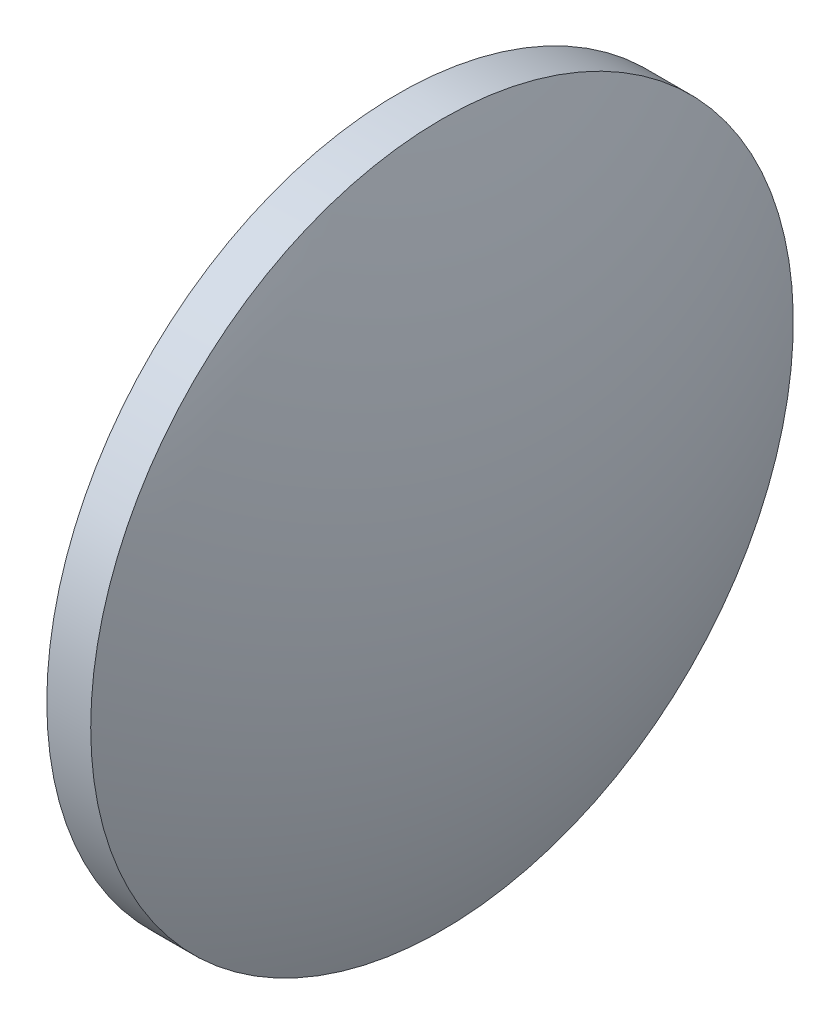
ISO-10303-21;
HEADER;
FILE_DESCRIPTION(('STEP AP214'),'2;1');
FILE_NAME('part.step','',(''),(''),'','','');
FILE_SCHEMA(('AUTOMOTIVE_DESIGN { 1 0 10303 214 1 1 1 1 }'));
ENDSEC;
DATA;
#1=APPLICATION_CONTEXT('core data for automotive mechanical design processes');
#2=APPLICATION_PROTOCOL_DEFINITION('international standard','automotive_design',2000,#1);
#3=PRODUCT_CONTEXT('',#1,'mechanical');
#4=PRODUCT('Part','Part','',(#3));
#5=PRODUCT_RELATED_PRODUCT_CATEGORY('part','',(#4));
#6=PRODUCT_DEFINITION_FORMATION('','',#4);
#7=PRODUCT_DEFINITION_CONTEXT('part definition',#1,'design');
#8=PRODUCT_DEFINITION('design','',#6,#7);
#9=PRODUCT_DEFINITION_SHAPE('','',#8);
#10=(LENGTH_UNIT() NAMED_UNIT(*) SI_UNIT(.MILLI.,.METRE.));
#11=(NAMED_UNIT(*) PLANE_ANGLE_UNIT() SI_UNIT($,.RADIAN.));
#12=(NAMED_UNIT(*) SI_UNIT($,.STERADIAN.) SOLID_ANGLE_UNIT());
#13=UNCERTAINTY_MEASURE_WITH_UNIT(LENGTH_MEASURE(1.E-05),#10,'distance_accuracy_value','');
#14=(GEOMETRIC_REPRESENTATION_CONTEXT(3) GLOBAL_UNCERTAINTY_ASSIGNED_CONTEXT((#13)) GLOBAL_UNIT_ASSIGNED_CONTEXT((#10,
#11,#12)) REPRESENTATION_CONTEXT('',''));
#15=CARTESIAN_POINT('',(0.,0.,0.));
#16=DIRECTION('',(0.,0.,1.));
#17=DIRECTION('',(1.,0.,0.));
#18=AXIS2_PLACEMENT_3D('',#15,#16,#17);
#19=CARTESIAN_POINT('',(495.350514735523,183.981187910867,0.));
#20=DIRECTION('',(-1.,0.,0.));
#21=DIRECTION('',(0.,1.,0.));
#22=AXIS2_PLACEMENT_3D('',#19,#20,#21);
#23=SPHERICAL_SURFACE('',#22,51.6427915632755);
#24=CARTESIAN_POINT('',(542.963306298798,183.981187910867,0.));
#25=DIRECTION('',(-1.,0.,0.));
#26=DIRECTION('',(0.,0.,1.));
#27=AXIS2_PLACEMENT_3D('',#24,#25,#26);
#28=CIRCLE('',#27,20.);
#29=CARTESIAN_POINT('',(542.963306298798,183.981187910867,20.));
#30=VERTEX_POINT('',#29);
#31=EDGE_CURVE('E10',#30,#30,#28,.T.);
#32=ORIENTED_EDGE('',*,*,#31,.F.);
#33=EDGE_LOOP('',(#32));
#34=FACE_BOUND('',#33,.T.);
#35=ADVANCED_FACE('F35',(#34),#23,.T.);
#36=CARTESIAN_POINT('',(530.956808979025,183.981187910867,0.));
#37=DIRECTION('',(-1.,0.,0.));
#38=DIRECTION('',(0.,0.,1.));
#39=AXIS2_PLACEMENT_3D('',#36,#37,#38);
#40=CYLINDRICAL_SURFACE('',#39,20.);
#41=CARTESIAN_POINT('',(540.463306298798,183.981187910867,0.));
#42=DIRECTION('',(-1.,0.,0.));
#43=DIRECTION('',(0.,0.,1.));
#44=AXIS2_PLACEMENT_3D('',#41,#42,#43);
#45=CIRCLE('',#44,20.);
#46=CARTESIAN_POINT('',(540.463306298798,183.981187910867,20.));
#47=VERTEX_POINT('',#46);
#48=EDGE_CURVE('E41',#47,#47,#45,.T.);
#49=ORIENTED_EDGE('',*,*,#48,.F.);
#50=EDGE_LOOP('',(#49));
#51=FACE_BOUND('',#50,.T.);
#52=ORIENTED_EDGE('',*,*,#31,.T.);
#53=EDGE_LOOP('',(#52));
#54=FACE_BOUND('',#53,.T.);
#55=ADVANCED_FACE('F49',(#51,#54),#40,.T.);
#56=CARTESIAN_POINT('',(540.463306298798,183.981187910867,0.));
#57=DIRECTION('',(1.,0.,0.));
#58=DIRECTION('',(0.,0.,-1.));
#59=AXIS2_PLACEMENT_3D('',#56,#57,#58);
#60=PLANE('',#59);
#61=ORIENTED_EDGE('',*,*,#48,.T.);
#62=EDGE_LOOP('',(#61));
#63=FACE_BOUND('',#62,.T.);
#64=ADVANCED_FACE('F47',(#63),#60,.F.);
#65=CLOSED_SHELL('',(#35,#55,#64));
#66=MANIFOLD_SOLID_BREP('B2',#65);
#67=ADVANCED_BREP_SHAPE_REPRESENTATION('',(#18,#66),#14);
#68=SHAPE_DEFINITION_REPRESENTATION(#9,#67);
ENDSEC;
END-ISO-10303-21;
